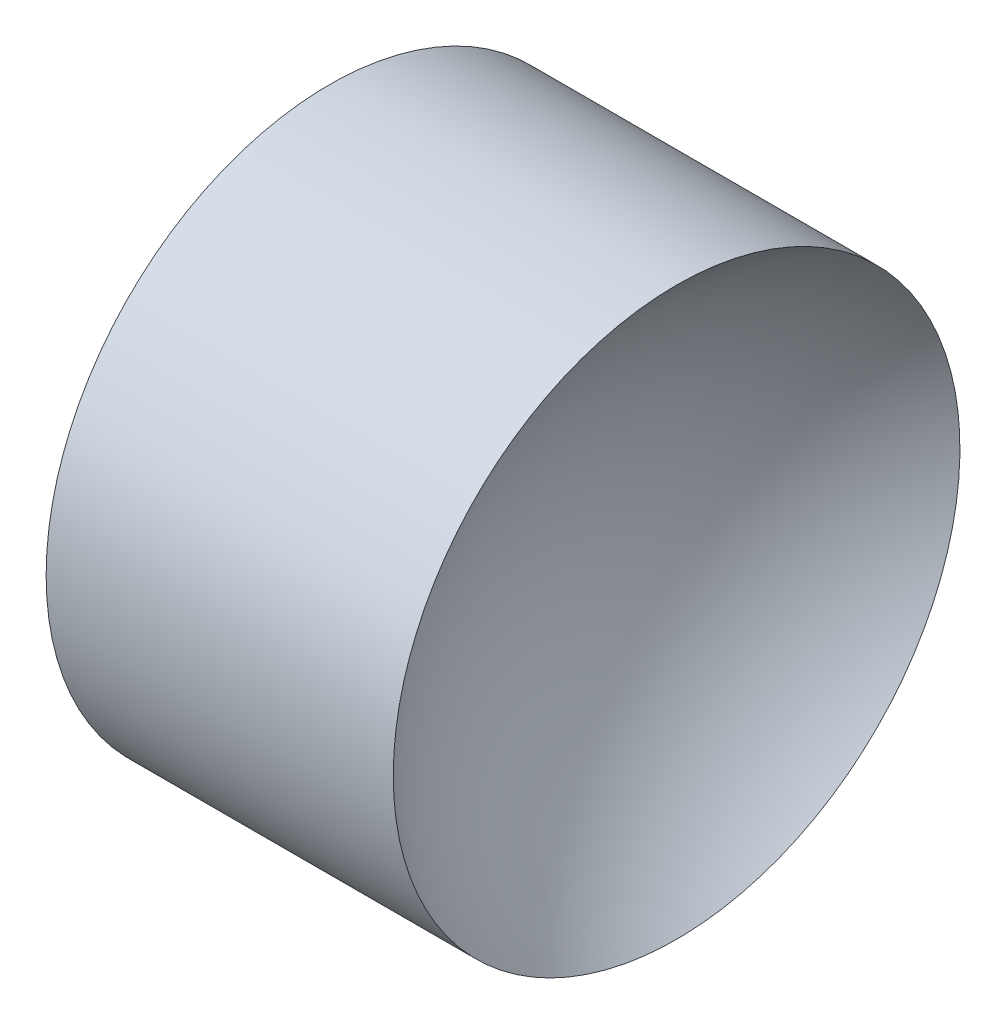
ISO-10303-21;
HEADER;
FILE_DESCRIPTION(('STEP AP214'),'2;1');
FILE_NAME('part.step','',(''),(''),'','','');
FILE_SCHEMA(('AUTOMOTIVE_DESIGN { 1 0 10303 214 1 1 1 1 }'));
ENDSEC;
DATA;
#1=APPLICATION_CONTEXT('core data for automotive mechanical design processes');
#2=APPLICATION_PROTOCOL_DEFINITION('international standard','automotive_design',2000,#1);
#3=PRODUCT_CONTEXT('',#1,'mechanical');
#4=PRODUCT('Part','Part','',(#3));
#5=PRODUCT_RELATED_PRODUCT_CATEGORY('part','',(#4));
#6=PRODUCT_DEFINITION_FORMATION('','',#4);
#7=PRODUCT_DEFINITION_CONTEXT('part definition',#1,'design');
#8=PRODUCT_DEFINITION('design','',#6,#7);
#9=PRODUCT_DEFINITION_SHAPE('','',#8);
#10=(LENGTH_UNIT() NAMED_UNIT(*) SI_UNIT(.MILLI.,.METRE.));
#11=(NAMED_UNIT(*) PLANE_ANGLE_UNIT() SI_UNIT($,.RADIAN.));
#12=(NAMED_UNIT(*) SI_UNIT($,.STERADIAN.) SOLID_ANGLE_UNIT());
#13=UNCERTAINTY_MEASURE_WITH_UNIT(LENGTH_MEASURE(1.E-05),#10,'distance_accuracy_value','');
#14=(GEOMETRIC_REPRESENTATION_CONTEXT(3) GLOBAL_UNCERTAINTY_ASSIGNED_CONTEXT((#13)) GLOBAL_UNIT_ASSIGNED_CONTEXT((#10,
#11,#12)) REPRESENTATION_CONTEXT('',''));
#15=CARTESIAN_POINT('',(0.,0.,0.));
#16=DIRECTION('',(0.,0.,1.));
#17=DIRECTION('',(1.,0.,0.));
#18=AXIS2_PLACEMENT_3D('',#15,#16,#17);
#19=CARTESIAN_POINT('',(15.2369898758655,6.51556304570152,0.));
#20=DIRECTION('',(-1.,0.,0.));
#21=DIRECTION('',(0.,1.,0.));
#22=AXIS2_PLACEMENT_3D('',#19,#20,#21);
#23=SPHERICAL_SURFACE('',#22,2.58);
#24=CARTESIAN_POINT('',(13.6071432573151,6.51556304570152,0.));
#25=DIRECTION('',(-1.,0.,0.));
#26=DIRECTION('',(0.,0.,1.));
#27=AXIS2_PLACEMENT_3D('',#24,#25,#26);
#28=CIRCLE('',#27,2.);
#29=CARTESIAN_POINT('',(13.6071432573151,6.51556304570152,2.));
#30=VERTEX_POINT('',#29);
#31=EDGE_CURVE('E10',#30,#30,#28,.T.);
#32=ORIENTED_EDGE('',*,*,#31,.F.);
#33=EDGE_LOOP('',(#32));
#34=FACE_BOUND('',#33,.T.);
#35=ADVANCED_FACE('F35',(#34),#23,.F.);
#36=CARTESIAN_POINT('',(10.3420153175664,6.51556304570152,0.));
#37=DIRECTION('',(-1.,0.,0.));
#38=DIRECTION('',(0.,0.,1.));
#39=AXIS2_PLACEMENT_3D('',#36,#37,#38);
#40=CYLINDRICAL_SURFACE('',#39,2.);
#41=CARTESIAN_POINT('',(11.1569898758655,6.51556304570152,0.));
#42=DIRECTION('',(-1.,0.,0.));
#43=DIRECTION('',(0.,0.,1.));
#44=AXIS2_PLACEMENT_3D('',#41,#42,#43);
#45=CIRCLE('',#44,2.);
#46=CARTESIAN_POINT('',(11.1569898758655,6.51556304570152,2.));
#47=VERTEX_POINT('',#46);
#48=EDGE_CURVE('E41',#47,#47,#45,.T.);
#49=ORIENTED_EDGE('',*,*,#48,.F.);
#50=EDGE_LOOP('',(#49));
#51=FACE_BOUND('',#50,.T.);
#52=ORIENTED_EDGE('',*,*,#31,.T.);
#53=EDGE_LOOP('',(#52));
#54=FACE_BOUND('',#53,.T.);
#55=ADVANCED_FACE('F49',(#51,#54),#40,.T.);
#56=CARTESIAN_POINT('',(11.1569898758655,6.51556304570152,0.));
#57=DIRECTION('',(1.,0.,0.));
#58=DIRECTION('',(0.,0.,-1.));
#59=AXIS2_PLACEMENT_3D('',#56,#57,#58);
#60=PLANE('',#59);
#61=ORIENTED_EDGE('',*,*,#48,.T.);
#62=EDGE_LOOP('',(#61));
#63=FACE_BOUND('',#62,.T.);
#64=ADVANCED_FACE('F47',(#63),#60,.F.);
#65=CLOSED_SHELL('',(#35,#55,#64));
#66=MANIFOLD_SOLID_BREP('B2',#65);
#67=ADVANCED_BREP_SHAPE_REPRESENTATION('',(#18,#66),#14);
#68=SHAPE_DEFINITION_REPRESENTATION(#9,#67);
ENDSEC;
END-ISO-10303-21;
